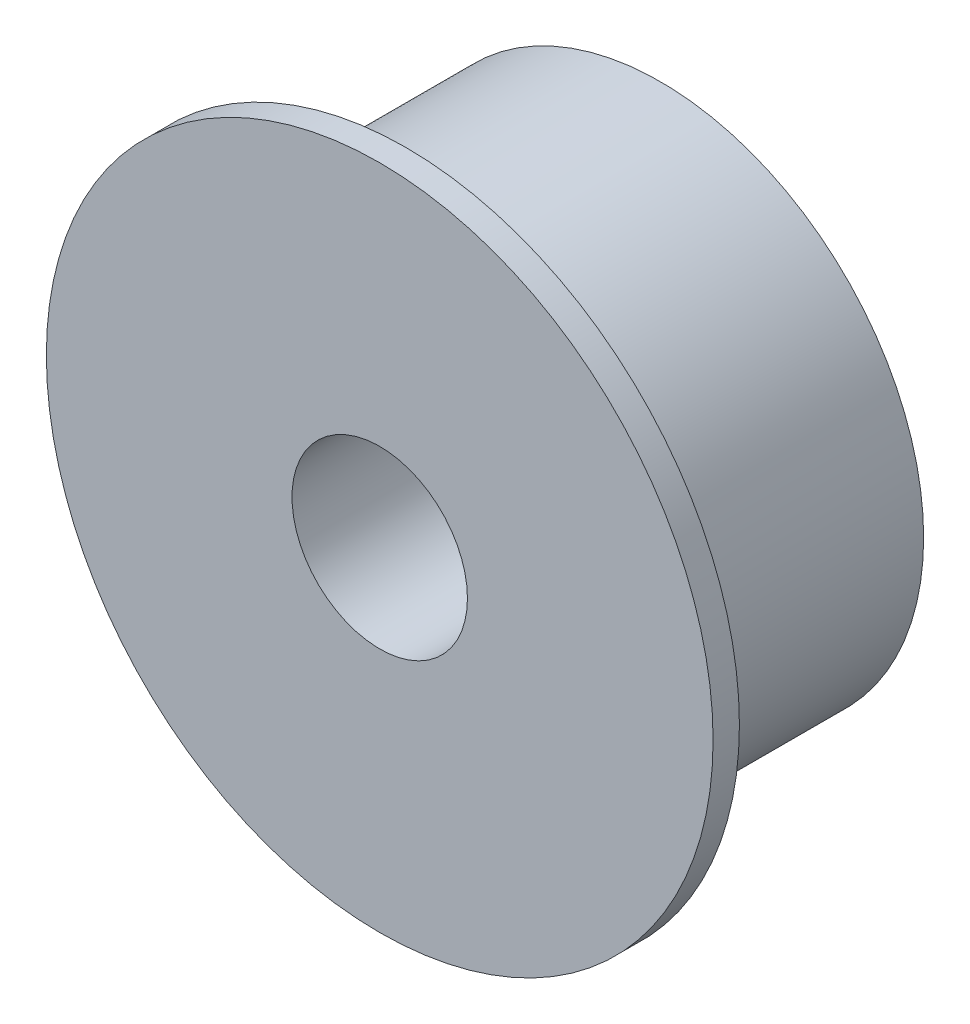
ISO-10303-21;
HEADER;
FILE_DESCRIPTION(('STEP AP214'),'2;1');
FILE_NAME('part.step','',(''),(''),'','','');
FILE_SCHEMA(('AUTOMOTIVE_DESIGN { 1 0 10303 214 1 1 1 1 }'));
ENDSEC;
DATA;
#1=APPLICATION_CONTEXT('core data for automotive mechanical design processes');
#2=APPLICATION_PROTOCOL_DEFINITION('international standard','automotive_design',2000,#1);
#3=PRODUCT_CONTEXT('',#1,'mechanical');
#4=PRODUCT('Part','Part','',(#3));
#5=PRODUCT_RELATED_PRODUCT_CATEGORY('part','',(#4));
#6=PRODUCT_DEFINITION_FORMATION('','',#4);
#7=PRODUCT_DEFINITION_CONTEXT('part definition',#1,'design');
#8=PRODUCT_DEFINITION('design','',#6,#7);
#9=PRODUCT_DEFINITION_SHAPE('','',#8);
#10=(LENGTH_UNIT() NAMED_UNIT(*) SI_UNIT(.MILLI.,.METRE.));
#11=(NAMED_UNIT(*) PLANE_ANGLE_UNIT() SI_UNIT($,.RADIAN.));
#12=(NAMED_UNIT(*) SI_UNIT($,.STERADIAN.) SOLID_ANGLE_UNIT());
#13=UNCERTAINTY_MEASURE_WITH_UNIT(LENGTH_MEASURE(1.E-05),#10,'distance_accuracy_value','');
#14=(GEOMETRIC_REPRESENTATION_CONTEXT(3) GLOBAL_UNCERTAINTY_ASSIGNED_CONTEXT((#13)) GLOBAL_UNIT_ASSIGNED_CONTEXT((#10,
#11,#12)) REPRESENTATION_CONTEXT('',''));
#15=CARTESIAN_POINT('',(0.,0.,0.));
#16=DIRECTION('',(0.,0.,1.));
#17=DIRECTION('',(1.,0.,0.));
#18=AXIS2_PLACEMENT_3D('',#15,#16,#17);
#19=CARTESIAN_POINT('',(0.,0.,8.));
#20=DIRECTION('',(0.,0.,-1.));
#21=DIRECTION('',(-1.,0.,0.));
#22=AXIS2_PLACEMENT_3D('',#19,#20,#21);
#23=CYLINDRICAL_SURFACE('',#22,7.5);
#24=CARTESIAN_POINT('',(0.,0.,0.));
#25=DIRECTION('',(0.,0.,1.));
#26=DIRECTION('',(1.,0.,0.));
#27=AXIS2_PLACEMENT_3D('',#24,#25,#26);
#28=CIRCLE('',#27,7.5);
#29=CARTESIAN_POINT('',(7.5,0.,0.));
#30=VERTEX_POINT('',#29);
#31=EDGE_CURVE('E34',#30,#30,#28,.T.);
#32=ORIENTED_EDGE('',*,*,#31,.T.);
#33=EDGE_LOOP('',(#32));
#34=FACE_BOUND('',#33,.T.);
#35=CARTESIAN_POINT('',(0.,0.,7.25));
#36=DIRECTION('',(0.,0.,1.));
#37=DIRECTION('',(1.,0.,0.));
#38=AXIS2_PLACEMENT_3D('',#35,#36,#37);
#39=CIRCLE('',#38,7.5);
#40=CARTESIAN_POINT('',(7.5,0.,7.25));
#41=VERTEX_POINT('',#40);
#42=EDGE_CURVE('E10',#41,#41,#39,.T.);
#43=ORIENTED_EDGE('',*,*,#42,.F.);
#44=EDGE_LOOP('',(#43));
#45=FACE_BOUND('',#44,.T.);
#46=ADVANCED_FACE('F28',(#34,#45),#23,.T.);
#47=CARTESIAN_POINT('',(0.,0.,8.));
#48=DIRECTION('',(0.,0.,1.));
#49=DIRECTION('',(1.,0.,0.));
#50=AXIS2_PLACEMENT_3D('',#47,#48,#49);
#51=PLANE('',#50);
#52=CARTESIAN_POINT('',(0.,0.,8.));
#53=DIRECTION('',(0.,0.,1.));
#54=DIRECTION('',(1.,0.,0.));
#55=AXIS2_PLACEMENT_3D('',#52,#53,#54);
#56=CIRCLE('',#55,9.5);
#57=CARTESIAN_POINT('',(9.5,0.,8.));
#58=VERTEX_POINT('',#57);
#59=EDGE_CURVE('E48',#58,#58,#56,.T.);
#60=ORIENTED_EDGE('',*,*,#59,.T.);
#61=EDGE_LOOP('',(#60));
#62=FACE_BOUND('',#61,.T.);
#63=CARTESIAN_POINT('',(0.,0.,8.));
#64=DIRECTION('',(0.,0.,1.));
#65=DIRECTION('',(1.,0.,0.));
#66=AXIS2_PLACEMENT_3D('',#63,#64,#65);
#67=CIRCLE('',#66,2.5);
#68=CARTESIAN_POINT('',(2.5,0.,8.));
#69=VERTEX_POINT('',#68);
#70=EDGE_CURVE('E38',#69,#69,#67,.T.);
#71=ORIENTED_EDGE('',*,*,#70,.F.);
#72=EDGE_LOOP('',(#71));
#73=FACE_BOUND('',#72,.T.);
#74=ADVANCED_FACE('F70',(#62,#73),#51,.T.);
#75=CARTESIAN_POINT('',(0.,0.,0.));
#76=DIRECTION('',(0.,0.,1.));
#77=DIRECTION('',(1.,0.,0.));
#78=AXIS2_PLACEMENT_3D('',#75,#76,#77);
#79=PLANE('',#78);
#80=ORIENTED_EDGE('',*,*,#31,.F.);
#81=EDGE_LOOP('',(#80));
#82=FACE_BOUND('',#81,.T.);
#83=CARTESIAN_POINT('',(0.,0.,0.));
#84=DIRECTION('',(0.,0.,1.));
#85=DIRECTION('',(1.,0.,0.));
#86=AXIS2_PLACEMENT_3D('',#83,#84,#85);
#87=CIRCLE('',#86,2.5);
#88=CARTESIAN_POINT('',(2.5,0.,0.));
#89=VERTEX_POINT('',#88);
#90=EDGE_CURVE('E42',#89,#89,#87,.T.);
#91=ORIENTED_EDGE('',*,*,#90,.T.);
#92=EDGE_LOOP('',(#91));
#93=FACE_BOUND('',#92,.T.);
#94=ADVANCED_FACE('F66',(#82,#93),#79,.F.);
#95=CARTESIAN_POINT('',(0.,0.,8.));
#96=DIRECTION('',(0.,0.,-1.));
#97=DIRECTION('',(-1.,0.,0.));
#98=AXIS2_PLACEMENT_3D('',#95,#96,#97);
#99=CYLINDRICAL_SURFACE('',#98,2.5);
#100=ORIENTED_EDGE('',*,*,#70,.T.);
#101=EDGE_LOOP('',(#100));
#102=FACE_BOUND('',#101,.T.);
#103=ORIENTED_EDGE('',*,*,#90,.F.);
#104=EDGE_LOOP('',(#103));
#105=FACE_BOUND('',#104,.T.);
#106=ADVANCED_FACE('F59',(#102,#105),#99,.F.);
#107=CARTESIAN_POINT('',(0.,0.,7.25));
#108=DIRECTION('',(0.,0.,1.));
#109=DIRECTION('',(1.,0.,0.));
#110=AXIS2_PLACEMENT_3D('',#107,#108,#109);
#111=PLANE('',#110);
#112=CARTESIAN_POINT('',(0.,0.,7.25));
#113=DIRECTION('',(0.,0.,1.));
#114=DIRECTION('',(1.,0.,0.));
#115=AXIS2_PLACEMENT_3D('',#112,#113,#114);
#116=CIRCLE('',#115,9.5);
#117=CARTESIAN_POINT('',(9.5,0.,7.25));
#118=VERTEX_POINT('',#117);
#119=EDGE_CURVE('E46',#118,#118,#116,.T.);
#120=ORIENTED_EDGE('',*,*,#119,.F.);
#121=EDGE_LOOP('',(#120));
#122=FACE_BOUND('',#121,.T.);
#123=ORIENTED_EDGE('',*,*,#42,.T.);
#124=EDGE_LOOP('',(#123));
#125=FACE_BOUND('',#124,.T.);
#126=ADVANCED_FACE('F57',(#122,#125),#111,.F.);
#127=CARTESIAN_POINT('',(0.,0.,7.25));
#128=DIRECTION('',(0.,0.,1.));
#129=DIRECTION('',(1.,0.,0.));
#130=AXIS2_PLACEMENT_3D('',#127,#128,#129);
#131=CYLINDRICAL_SURFACE('',#130,9.5);
#132=ORIENTED_EDGE('',*,*,#119,.T.);
#133=EDGE_LOOP('',(#132));
#134=FACE_BOUND('',#133,.T.);
#135=ORIENTED_EDGE('',*,*,#59,.F.);
#136=EDGE_LOOP('',(#135));
#137=FACE_BOUND('',#136,.T.);
#138=ADVANCED_FACE('F54',(#134,#137),#131,.T.);
#139=CLOSED_SHELL('',(#46,#74,#94,#106,#126,#138));
#140=MANIFOLD_SOLID_BREP('B2',#139);
#141=ADVANCED_BREP_SHAPE_REPRESENTATION('',(#18,#140),#14);
#142=SHAPE_DEFINITION_REPRESENTATION(#9,#141);
ENDSEC;
END-ISO-10303-21;
